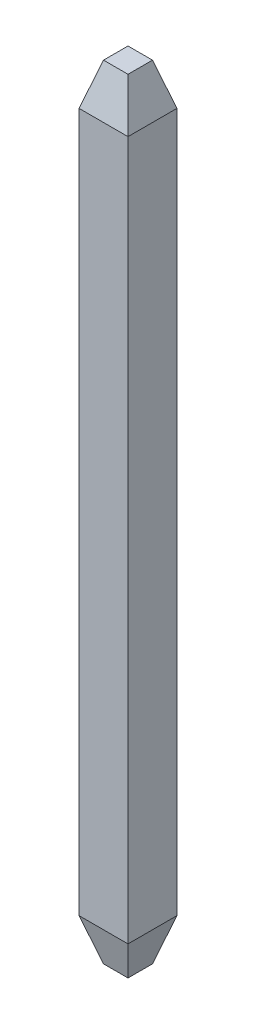
ISO-10303-21;
HEADER;
FILE_DESCRIPTION(('STEP AP214'),'2;1');
FILE_NAME('part.step','',(''),(''),'','','');
FILE_SCHEMA(('AUTOMOTIVE_DESIGN { 1 0 10303 214 1 1 1 1 }'));
ENDSEC;
DATA;
#1=APPLICATION_CONTEXT('core data for automotive mechanical design processes');
#2=APPLICATION_PROTOCOL_DEFINITION('international standard','automotive_design',2000,#1);
#3=PRODUCT_CONTEXT('',#1,'mechanical');
#4=PRODUCT('Part','Part','',(#3));
#5=PRODUCT_RELATED_PRODUCT_CATEGORY('part','',(#4));
#6=PRODUCT_DEFINITION_FORMATION('','',#4);
#7=PRODUCT_DEFINITION_CONTEXT('part definition',#1,'design');
#8=PRODUCT_DEFINITION('design','',#6,#7);
#9=PRODUCT_DEFINITION_SHAPE('','',#8);
#10=(LENGTH_UNIT() NAMED_UNIT(*) SI_UNIT(.MILLI.,.METRE.));
#11=(NAMED_UNIT(*) PLANE_ANGLE_UNIT() SI_UNIT($,.RADIAN.));
#12=(NAMED_UNIT(*) SI_UNIT($,.STERADIAN.) SOLID_ANGLE_UNIT());
#13=UNCERTAINTY_MEASURE_WITH_UNIT(LENGTH_MEASURE(1.E-05),#10,'distance_accuracy_value','');
#14=(GEOMETRIC_REPRESENTATION_CONTEXT(3) GLOBAL_UNCERTAINTY_ASSIGNED_CONTEXT((#13)) GLOBAL_UNIT_ASSIGNED_CONTEXT((#10,
#11,#12)) REPRESENTATION_CONTEXT('',''));
#15=CARTESIAN_POINT('',(0.,0.,0.));
#16=DIRECTION('',(0.,0.,1.));
#17=DIRECTION('',(1.,0.,0.));
#18=AXIS2_PLACEMENT_3D('',#15,#16,#17);
#19=CARTESIAN_POINT('',(-9.04999999998702,-5.53543505344795,-16.6589999999763));
#20=DIRECTION('',(-1.,0.,0.));
#21=DIRECTION('',(0.,0.,1.));
#22=AXIS2_PLACEMENT_3D('',#19,#20,#21);
#23=PLANE('',#22);
#24=DIRECTION('',(0.,1.,0.));
#25=VECTOR('',#24,1.);
#26=CARTESIAN_POINT('',(-9.04999999998702,-10.1039999999832,-17.2999999999763));
#27=LINE('',#26,#25);
#28=CARTESIAN_POINT('',(-9.04999999998702,-10.1039999999832,-17.2999999999763));
#29=VERTEX_POINT('',#28);
#30=CARTESIAN_POINT('',(-9.04999999998702,-0.965870106912691,-17.2999999999763));
#31=VERTEX_POINT('',#30);
#32=EDGE_CURVE('E167',#29,#31,#27,.T.);
#33=ORIENTED_EDGE('',*,*,#32,.F.);
#34=DIRECTION('',(0.,0.,-1.));
#35=VECTOR('',#34,1.);
#36=CARTESIAN_POINT('',(-9.04999999998702,-10.1039999999832,-16.6599999999763));
#37=LINE('',#36,#35);
#38=CARTESIAN_POINT('',(-9.04999999998702,-10.1039999999832,-16.6599999999763));
#39=VERTEX_POINT('',#38);
#40=EDGE_CURVE('E42',#39,#29,#37,.T.);
#41=ORIENTED_EDGE('',*,*,#40,.F.);
#42=DIRECTION('',(0.,1.,0.));
#43=VECTOR('',#42,1.);
#44=CARTESIAN_POINT('',(-9.04999999998702,-10.1039999999832,-16.6599999999763));
#45=LINE('',#44,#43);
#46=CARTESIAN_POINT('',(-9.04999999998702,-0.965870106912691,-16.6599999999763));
#47=VERTEX_POINT('',#46);
#48=EDGE_CURVE('E11',#39,#47,#45,.T.);
#49=ORIENTED_EDGE('',*,*,#48,.T.);
#50=DIRECTION('',(0.,0.,-1.));
#51=VECTOR('',#50,1.);
#52=CARTESIAN_POINT('',(-9.04999999998702,-0.965870106912693,-16.6599999999763));
#53=LINE('',#52,#51);
#54=EDGE_CURVE('E28',#47,#31,#53,.T.);
#55=ORIENTED_EDGE('',*,*,#54,.T.);
#56=EDGE_LOOP('',(#33,#41,#49,#55));
#57=FACE_BOUND('',#56,.T.);
#58=ADVANCED_FACE('F17',(#57),#23,.T.);
#59=CARTESIAN_POINT('',(-8.408999999987,-5.53443505344795,-17.2999999999763));
#60=DIRECTION('',(0.,0.,-1.));
#61=DIRECTION('',(0.,-1.,0.));
#62=AXIS2_PLACEMENT_3D('',#59,#60,#61);
#63=PLANE('',#62);
#64=DIRECTION('',(0.,1.,0.));
#65=VECTOR('',#64,1.);
#66=CARTESIAN_POINT('',(-8.40999999998701,-10.1039999999832,-17.2999999999763));
#67=LINE('',#66,#65);
#68=CARTESIAN_POINT('',(-8.40999999998704,-10.1039999999832,-17.2999999999763));
#69=VERTEX_POINT('',#68);
#70=CARTESIAN_POINT('',(-8.40999999998704,-0.965870106912691,-17.2999999999763));
#71=VERTEX_POINT('',#70);
#72=EDGE_CURVE('E123',#69,#71,#67,.T.);
#73=ORIENTED_EDGE('',*,*,#72,.F.);
#74=DIRECTION('',(1.,0.,0.));
#75=VECTOR('',#74,1.);
#76=CARTESIAN_POINT('',(-9.04999999998702,-10.1039999999832,-17.2999999999763));
#77=LINE('',#76,#75);
#78=EDGE_CURVE('E104',#29,#69,#77,.T.);
#79=ORIENTED_EDGE('',*,*,#78,.F.);
#80=ORIENTED_EDGE('',*,*,#32,.T.);
#81=DIRECTION('',(1.,0.,0.));
#82=VECTOR('',#81,1.);
#83=CARTESIAN_POINT('',(-9.04999999998702,-0.965870106912693,-17.2999999999763));
#84=LINE('',#83,#82);
#85=EDGE_CURVE('E134',#31,#71,#84,.T.);
#86=ORIENTED_EDGE('',*,*,#85,.T.);
#87=EDGE_LOOP('',(#73,#79,#80,#86));
#88=FACE_BOUND('',#87,.T.);
#89=ADVANCED_FACE('F133',(#88),#63,.T.);
#90=CARTESIAN_POINT('',(-8.40999999998701,-11.0738701069127,-16.9799999999763));
#91=DIRECTION('',(1.,0.,0.));
#92=DIRECTION('',(0.,1.,0.));
#93=AXIS2_PLACEMENT_3D('',#90,#91,#92);
#94=PLANE('',#93);
#95=DIRECTION('',(0.,1.,0.));
#96=VECTOR('',#95,1.);
#97=CARTESIAN_POINT('',(-8.40999999998701,-10.1039999999832,-16.6599999999763));
#98=LINE('',#97,#96);
#99=CARTESIAN_POINT('',(-8.40999999998704,-10.1039999999832,-16.6599999999763));
#100=VERTEX_POINT('',#99);
#101=CARTESIAN_POINT('',(-8.40999999998704,-0.965870106912691,-16.6599999999763));
#102=VERTEX_POINT('',#101);
#103=EDGE_CURVE('E125',#100,#102,#98,.T.);
#104=ORIENTED_EDGE('',*,*,#103,.F.);
#105=DIRECTION('',(0.,0.,1.));
#106=VECTOR('',#105,1.);
#107=CARTESIAN_POINT('',(-8.40999999998701,-10.1039999999832,-17.2999999999763));
#108=LINE('',#107,#106);
#109=EDGE_CURVE('E21',#69,#100,#108,.T.);
#110=ORIENTED_EDGE('',*,*,#109,.F.);
#111=ORIENTED_EDGE('',*,*,#72,.T.);
#112=DIRECTION('',(0.,0.,1.));
#113=VECTOR('',#112,1.);
#114=CARTESIAN_POINT('',(-8.40999999998701,-0.965870106912693,-17.2999999999763));
#115=LINE('',#114,#113);
#116=EDGE_CURVE('E137',#71,#102,#115,.T.);
#117=ORIENTED_EDGE('',*,*,#116,.T.);
#118=EDGE_LOOP('',(#104,#110,#111,#117));
#119=FACE_BOUND('',#118,.T.);
#120=ADVANCED_FACE('F19',(#119),#94,.T.);
#121=CARTESIAN_POINT('',(-8.40999999998701,-0.965870106912693,-16.9799999999763));
#122=DIRECTION('',(0.959644900900974,0.281214622974625,0.));
#123=DIRECTION('',(0.,0.,-1.));
#124=AXIS2_PLACEMENT_3D('',#121,#122,#123);
#125=PLANE('',#124);
#126=DIRECTION('',(-0.27071401714771,0.923811583516622,0.270714017147728));
#127=VECTOR('',#126,1.);
#128=CARTESIAN_POINT('',(-8.40999999998701,-0.965870106912693,-17.2999999999763));
#129=LINE('',#128,#127);
#130=CARTESIAN_POINT('',(-8.56999999998703,-0.419870106912692,-17.1399999999763));
#131=VERTEX_POINT('',#130);
#132=EDGE_CURVE('E161',#71,#131,#129,.T.);
#133=ORIENTED_EDGE('',*,*,#132,.T.);
#134=DIRECTION('',(0.,0.,1.));
#135=VECTOR('',#134,1.);
#136=CARTESIAN_POINT('',(-8.569999999987,-0.419870106912693,-17.1399999999763));
#137=LINE('',#136,#135);
#138=CARTESIAN_POINT('',(-8.56999999998703,-0.419870106912692,-16.8199999999763));
#139=VERTEX_POINT('',#138);
#140=EDGE_CURVE('E180',#131,#139,#137,.T.);
#141=ORIENTED_EDGE('',*,*,#140,.T.);
#142=DIRECTION('',(-0.27071401714771,0.923811583516622,-0.270714017147728));
#143=VECTOR('',#142,1.);
#144=CARTESIAN_POINT('',(-8.40999999998701,-0.965870106912693,-16.6599999999763));
#145=LINE('',#144,#143);
#146=EDGE_CURVE('E154',#102,#139,#145,.T.);
#147=ORIENTED_EDGE('',*,*,#146,.F.);
#148=ORIENTED_EDGE('',*,*,#116,.F.);
#149=EDGE_LOOP('',(#133,#141,#147,#148));
#150=FACE_BOUND('',#149,.T.);
#151=ADVANCED_FACE('F406',(#150),#125,.T.);
#152=CARTESIAN_POINT('',(-8.72999999998702,-0.965870106912693,-16.6599999999763));
#153=DIRECTION('',(0.,0.281214622974643,0.959644900900968));
#154=DIRECTION('',(1.,0.,0.));
#155=AXIS2_PLACEMENT_3D('',#152,#153,#154);
#156=PLANE('',#155);
#157=ORIENTED_EDGE('',*,*,#146,.T.);
#158=DIRECTION('',(-1.,0.,0.));
#159=VECTOR('',#158,1.);
#160=CARTESIAN_POINT('',(-8.569999999987,-0.419870106912693,-16.8199999999763));
#161=LINE('',#160,#159);
#162=CARTESIAN_POINT('',(-8.88999999998703,-0.419870106912692,-16.8199999999763));
#163=VERTEX_POINT('',#162);
#164=EDGE_CURVE('E131',#139,#163,#161,.T.);
#165=ORIENTED_EDGE('',*,*,#164,.T.);
#166=DIRECTION('',(0.270714017147713,0.923811583516621,-0.270714017147728));
#167=VECTOR('',#166,1.);
#168=CARTESIAN_POINT('',(-9.04999999998702,-0.965870106912693,-16.6599999999763));
#169=LINE('',#168,#167);
#170=EDGE_CURVE('E142',#47,#163,#169,.T.);
#171=ORIENTED_EDGE('',*,*,#170,.F.);
#172=DIRECTION('',(-1.,0.,0.));
#173=VECTOR('',#172,1.);
#174=CARTESIAN_POINT('',(-8.40999999998701,-0.965870106912693,-16.6599999999763));
#175=LINE('',#174,#173);
#176=EDGE_CURVE('E163',#102,#47,#175,.T.);
#177=ORIENTED_EDGE('',*,*,#176,.F.);
#178=EDGE_LOOP('',(#157,#165,#171,#177));
#179=FACE_BOUND('',#178,.T.);
#180=ADVANCED_FACE('F210',(#179),#156,.T.);
#181=CARTESIAN_POINT('',(-8.72999999998702,-0.419870106912693,-17.1409999999763));
#182=DIRECTION('',(0.,1.,0.));
#183=DIRECTION('',(1.,0.,0.));
#184=AXIS2_PLACEMENT_3D('',#181,#182,#183);
#185=PLANE('',#184);
#186=DIRECTION('',(1.,0.,0.));
#187=VECTOR('',#186,1.);
#188=CARTESIAN_POINT('',(-8.88999999998703,-0.419870106912693,-17.1399999999763));
#189=LINE('',#188,#187);
#190=CARTESIAN_POINT('',(-8.88999999998703,-0.419870106912692,-17.1399999999763));
#191=VERTEX_POINT('',#190);
#192=EDGE_CURVE('E116',#191,#131,#189,.T.);
#193=ORIENTED_EDGE('',*,*,#192,.F.);
#194=DIRECTION('',(0.,0.,-1.));
#195=VECTOR('',#194,1.);
#196=CARTESIAN_POINT('',(-8.88999999998703,-0.419870106912693,-16.8199999999763));
#197=LINE('',#196,#195);
#198=EDGE_CURVE('E148',#163,#191,#197,.T.);
#199=ORIENTED_EDGE('',*,*,#198,.F.);
#200=ORIENTED_EDGE('',*,*,#164,.F.);
#201=ORIENTED_EDGE('',*,*,#140,.F.);
#202=EDGE_LOOP('',(#193,#199,#200,#201));
#203=FACE_BOUND('',#202,.T.);
#204=ADVANCED_FACE('F365',(#203),#185,.T.);
#205=CARTESIAN_POINT('',(-8.40999999998701,-10.1039999999832,-16.9799999999763));
#206=DIRECTION('',(0.959644900900974,-0.281214622974625,0.));
#207=DIRECTION('',(0.,0.,-1.));
#208=AXIS2_PLACEMENT_3D('',#205,#206,#207);
#209=PLANE('',#208);
#210=ORIENTED_EDGE('',*,*,#109,.T.);
#211=DIRECTION('',(-0.27071401714771,-0.923811583516622,-0.270714017147728));
#212=VECTOR('',#211,1.);
#213=CARTESIAN_POINT('',(-8.40999999998701,-10.1039999999832,-16.6599999999763));
#214=LINE('',#213,#212);
#215=CARTESIAN_POINT('',(-8.56999999998703,-10.6499999999832,-16.8199999999763));
#216=VERTEX_POINT('',#215);
#217=EDGE_CURVE('E132',#100,#216,#214,.T.);
#218=ORIENTED_EDGE('',*,*,#217,.T.);
#219=DIRECTION('',(0.,0.,1.));
#220=VECTOR('',#219,1.);
#221=CARTESIAN_POINT('',(-8.569999999987,-10.6499999999832,-17.1399999999763));
#222=LINE('',#221,#220);
#223=CARTESIAN_POINT('',(-8.56999999998703,-10.6499999999832,-17.1399999999763));
#224=VERTEX_POINT('',#223);
#225=EDGE_CURVE('E140',#224,#216,#222,.T.);
#226=ORIENTED_EDGE('',*,*,#225,.F.);
#227=DIRECTION('',(-0.27071401714771,-0.923811583516622,0.270714017147728));
#228=VECTOR('',#227,1.);
#229=CARTESIAN_POINT('',(-8.40999999998701,-10.1039999999832,-17.2999999999763));
#230=LINE('',#229,#228);
#231=EDGE_CURVE('E108',#69,#224,#230,.T.);
#232=ORIENTED_EDGE('',*,*,#231,.F.);
#233=EDGE_LOOP('',(#210,#218,#226,#232));
#234=FACE_BOUND('',#233,.T.);
#235=ADVANCED_FACE('F139',(#234),#209,.T.);
#236=CARTESIAN_POINT('',(-8.890999999987,-10.6499999999832,-16.9799999999763));
#237=DIRECTION('',(0.,-1.,0.));
#238=DIRECTION('',(0.,0.,-1.));
#239=AXIS2_PLACEMENT_3D('',#236,#237,#238);
#240=PLANE('',#239);
#241=ORIENTED_EDGE('',*,*,#225,.T.);
#242=DIRECTION('',(-1.,0.,0.));
#243=VECTOR('',#242,1.);
#244=CARTESIAN_POINT('',(-8.569999999987,-10.6499999999832,-16.8199999999763));
#245=LINE('',#244,#243);
#246=CARTESIAN_POINT('',(-8.88999999998703,-10.6499999999832,-16.8199999999763));
#247=VERTEX_POINT('',#246);
#248=EDGE_CURVE('E158',#216,#247,#245,.T.);
#249=ORIENTED_EDGE('',*,*,#248,.T.);
#250=DIRECTION('',(0.,0.,-1.));
#251=VECTOR('',#250,1.);
#252=CARTESIAN_POINT('',(-8.88999999998703,-10.6499999999832,-16.8199999999763));
#253=LINE('',#252,#251);
#254=CARTESIAN_POINT('',(-8.88999999998703,-10.6499999999832,-17.1399999999763));
#255=VERTEX_POINT('',#254);
#256=EDGE_CURVE('E59',#247,#255,#253,.T.);
#257=ORIENTED_EDGE('',*,*,#256,.T.);
#258=DIRECTION('',(1.,0.,0.));
#259=VECTOR('',#258,1.);
#260=CARTESIAN_POINT('',(-8.88999999998703,-10.6499999999832,-17.1399999999763));
#261=LINE('',#260,#259);
#262=EDGE_CURVE('E72',#255,#224,#261,.T.);
#263=ORIENTED_EDGE('',*,*,#262,.T.);
#264=EDGE_LOOP('',(#241,#249,#257,#263));
#265=FACE_BOUND('',#264,.T.);
#266=ADVANCED_FACE('F270',(#265),#240,.T.);
#267=CARTESIAN_POINT('',(-8.72999999998702,-10.1039999999832,-16.6599999999763));
#268=DIRECTION('',(0.,-0.281214622974643,0.959644900900968));
#269=DIRECTION('',(-1.,0.,0.));
#270=AXIS2_PLACEMENT_3D('',#267,#268,#269);
#271=PLANE('',#270);
#272=DIRECTION('',(-1.,0.,0.));
#273=VECTOR('',#272,1.);
#274=CARTESIAN_POINT('',(-8.40999999998701,-10.1039999999832,-16.6599999999763));
#275=LINE('',#274,#273);
#276=EDGE_CURVE('E186',#100,#39,#275,.T.);
#277=ORIENTED_EDGE('',*,*,#276,.T.);
#278=DIRECTION('',(0.270714017147713,-0.923811583516621,-0.270714017147728));
#279=VECTOR('',#278,1.);
#280=CARTESIAN_POINT('',(-9.04999999998702,-10.1039999999832,-16.6599999999763));
#281=LINE('',#280,#279);
#282=EDGE_CURVE('E190',#39,#247,#281,.T.);
#283=ORIENTED_EDGE('',*,*,#282,.T.);
#284=ORIENTED_EDGE('',*,*,#248,.F.);
#285=ORIENTED_EDGE('',*,*,#217,.F.);
#286=EDGE_LOOP('',(#277,#283,#284,#285));
#287=FACE_BOUND('',#286,.T.);
#288=ADVANCED_FACE('F221',(#287),#271,.T.);
#289=CARTESIAN_POINT('',(-8.72999999998702,-0.965870106912693,-17.2999999999763));
#290=DIRECTION('',(0.,0.281214622974643,-0.959644900900968));
#291=DIRECTION('',(-1.,0.,0.));
#292=AXIS2_PLACEMENT_3D('',#289,#290,#291);
#293=PLANE('',#292);
#294=DIRECTION('',(0.270714017147713,0.923811583516621,0.270714017147728));
#295=VECTOR('',#294,1.);
#296=CARTESIAN_POINT('',(-9.04999999998702,-0.965870106912693,-17.2999999999763));
#297=LINE('',#296,#295);
#298=EDGE_CURVE('E179',#31,#191,#297,.T.);
#299=ORIENTED_EDGE('',*,*,#298,.T.);
#300=ORIENTED_EDGE('',*,*,#192,.T.);
#301=ORIENTED_EDGE('',*,*,#132,.F.);
#302=ORIENTED_EDGE('',*,*,#85,.F.);
#303=EDGE_LOOP('',(#299,#300,#301,#302));
#304=FACE_BOUND('',#303,.T.);
#305=ADVANCED_FACE('F398',(#304),#293,.T.);
#306=CARTESIAN_POINT('',(-8.72999999998702,-10.1039999999832,-17.2999999999763));
#307=DIRECTION('',(0.,-0.281214622974643,-0.959644900900968));
#308=DIRECTION('',(0.,-0.959644900900968,0.281214622974643));
#309=AXIS2_PLACEMENT_3D('',#306,#307,#308);
#310=PLANE('',#309);
#311=ORIENTED_EDGE('',*,*,#78,.T.);
#312=ORIENTED_EDGE('',*,*,#231,.T.);
#313=ORIENTED_EDGE('',*,*,#262,.F.);
#314=DIRECTION('',(0.270714017147713,-0.923811583516621,0.270714017147728));
#315=VECTOR('',#314,1.);
#316=CARTESIAN_POINT('',(-9.04999999998702,-10.1039999999832,-17.2999999999763));
#317=LINE('',#316,#315);
#318=EDGE_CURVE('E110',#29,#255,#317,.T.);
#319=ORIENTED_EDGE('',*,*,#318,.F.);
#320=EDGE_LOOP('',(#311,#312,#313,#319));
#321=FACE_BOUND('',#320,.T.);
#322=ADVANCED_FACE('F106',(#321),#310,.T.);
#323=CARTESIAN_POINT('',(-9.04999999998702,-0.965870106912693,-16.9799999999763));
#324=DIRECTION('',(-0.959644900900973,0.281214622974629,0.));
#325=DIRECTION('',(0.,0.,1.));
#326=AXIS2_PLACEMENT_3D('',#323,#324,#325);
#327=PLANE('',#326);
#328=ORIENTED_EDGE('',*,*,#170,.T.);
#329=ORIENTED_EDGE('',*,*,#198,.T.);
#330=ORIENTED_EDGE('',*,*,#298,.F.);
#331=ORIENTED_EDGE('',*,*,#54,.F.);
#332=EDGE_LOOP('',(#328,#329,#330,#331));
#333=FACE_BOUND('',#332,.T.);
#334=ADVANCED_FACE('F217',(#333),#327,.T.);
#335=CARTESIAN_POINT('',(-9.050999999987,-5.53543505344795,-16.6599999999763));
#336=DIRECTION('',(0.,0.,1.));
#337=DIRECTION('',(1.,0.,0.));
#338=AXIS2_PLACEMENT_3D('',#335,#336,#337);
#339=PLANE('',#338);
#340=ORIENTED_EDGE('',*,*,#48,.F.);
#341=ORIENTED_EDGE('',*,*,#276,.F.);
#342=ORIENTED_EDGE('',*,*,#103,.T.);
#343=ORIENTED_EDGE('',*,*,#176,.T.);
#344=EDGE_LOOP('',(#340,#341,#342,#343));
#345=FACE_BOUND('',#344,.T.);
#346=ADVANCED_FACE('F207',(#345),#339,.T.);
#347=CARTESIAN_POINT('',(-9.04999999998702,-10.1039999999832,-16.9799999999763));
#348=DIRECTION('',(-0.959644900900973,-0.281214622974629,0.));
#349=DIRECTION('',(-0.281214622974629,0.959644900900973,0.));
#350=AXIS2_PLACEMENT_3D('',#347,#348,#349);
#351=PLANE('',#350);
#352=ORIENTED_EDGE('',*,*,#40,.T.);
#353=ORIENTED_EDGE('',*,*,#318,.T.);
#354=ORIENTED_EDGE('',*,*,#256,.F.);
#355=ORIENTED_EDGE('',*,*,#282,.F.);
#356=EDGE_LOOP('',(#352,#353,#354,#355));
#357=FACE_BOUND('',#356,.T.);
#358=ADVANCED_FACE('F352',(#357),#351,.T.);
#359=CLOSED_SHELL('',(#58,#89,#120,#151,#180,#204,#235,#266,#288,#305,#322,#334,#346,#358));
#360=MANIFOLD_SOLID_BREP('B1',#359);
#361=ADVANCED_BREP_SHAPE_REPRESENTATION('',(#18,#360),#14);
#362=SHAPE_DEFINITION_REPRESENTATION(#9,#361);
ENDSEC;
END-ISO-10303-21;
